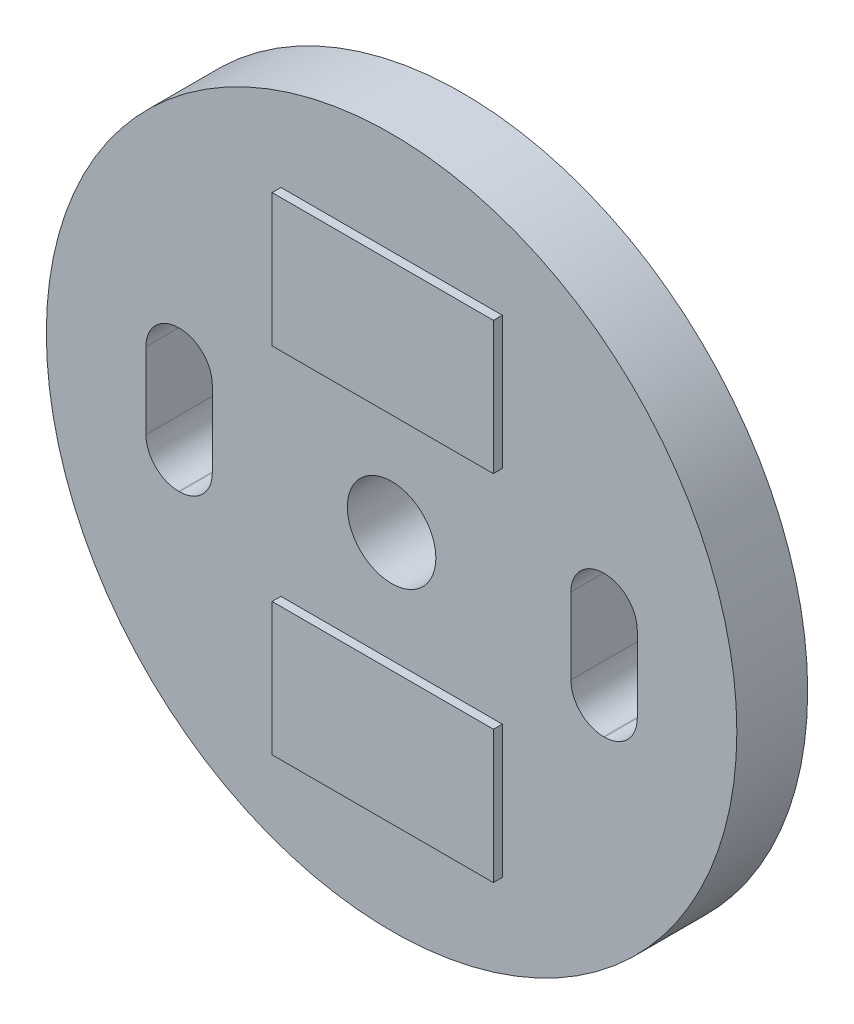
ISO-10303-21;
HEADER;
FILE_DESCRIPTION(('STEP AP214'),'2;1');
FILE_NAME('part.step','',(''),(''),'','','');
FILE_SCHEMA(('AUTOMOTIVE_DESIGN { 1 0 10303 214 1 1 1 1 }'));
ENDSEC;
DATA;
#1=APPLICATION_CONTEXT('core data for automotive mechanical design processes');
#2=APPLICATION_PROTOCOL_DEFINITION('international standard','automotive_design',2000,#1);
#3=PRODUCT_CONTEXT('',#1,'mechanical');
#4=PRODUCT('Part','Part','',(#3));
#5=PRODUCT_RELATED_PRODUCT_CATEGORY('part','',(#4));
#6=PRODUCT_DEFINITION_FORMATION('','',#4);
#7=PRODUCT_DEFINITION_CONTEXT('part definition',#1,'design');
#8=PRODUCT_DEFINITION('design','',#6,#7);
#9=PRODUCT_DEFINITION_SHAPE('','',#8);
#10=(LENGTH_UNIT() NAMED_UNIT(*) SI_UNIT(.MILLI.,.METRE.));
#11=(NAMED_UNIT(*) PLANE_ANGLE_UNIT() SI_UNIT($,.RADIAN.));
#12=(NAMED_UNIT(*) SI_UNIT($,.STERADIAN.) SOLID_ANGLE_UNIT());
#13=UNCERTAINTY_MEASURE_WITH_UNIT(LENGTH_MEASURE(1.E-05),#10,'distance_accuracy_value','');
#14=(GEOMETRIC_REPRESENTATION_CONTEXT(3) GLOBAL_UNCERTAINTY_ASSIGNED_CONTEXT((#13)) GLOBAL_UNIT_ASSIGNED_CONTEXT((#10,
#11,#12)) REPRESENTATION_CONTEXT('',''));
#15=CARTESIAN_POINT('',(0.,0.,0.));
#16=DIRECTION('',(0.,0.,1.));
#17=DIRECTION('',(1.,0.,0.));
#18=AXIS2_PLACEMENT_3D('',#15,#16,#17);
#19=CARTESIAN_POINT('',(0.,0.,0.8));
#20=DIRECTION('',(0.,0.,1.));
#21=DIRECTION('',(1.,0.,0.));
#22=AXIS2_PLACEMENT_3D('',#19,#20,#21);
#23=PLANE('',#22);
#24=CARTESIAN_POINT('',(0.,0.,0.8));
#25=DIRECTION('',(0.,0.,1.));
#26=DIRECTION('',(1.,0.,0.));
#27=AXIS2_PLACEMENT_3D('',#24,#25,#26);
#28=CIRCLE('',#27,3.9);
#29=CARTESIAN_POINT('',(3.9,0.,0.8));
#30=VERTEX_POINT('',#29);
#31=EDGE_CURVE('E11',#30,#30,#28,.T.);
#32=ORIENTED_EDGE('',*,*,#31,.T.);
#33=EDGE_LOOP('',(#32));
#34=FACE_BOUND('',#33,.T.);
#35=CARTESIAN_POINT('',(0.,0.,0.8));
#36=DIRECTION('',(0.,0.,1.));
#37=DIRECTION('',(1.,0.,0.));
#38=AXIS2_PLACEMENT_3D('',#35,#36,#37);
#39=CIRCLE('',#38,0.5);
#40=CARTESIAN_POINT('',(0.5,0.,0.8));
#41=VERTEX_POINT('',#40);
#42=EDGE_CURVE('E370',#41,#41,#39,.T.);
#43=ORIENTED_EDGE('',*,*,#42,.F.);
#44=EDGE_LOOP('',(#43));
#45=FACE_BOUND('',#44,.T.);
#46=DIRECTION('',(0.,1.,0.));
#47=VECTOR('',#46,1.);
#48=CARTESIAN_POINT('',(2.775,0.429999999999997,0.8));
#49=LINE('',#48,#47);
#50=CARTESIAN_POINT('',(2.775,-0.429999999999997,0.8));
#51=VERTEX_POINT('',#50);
#52=CARTESIAN_POINT('',(2.775,0.429999999999997,0.8));
#53=VERTEX_POINT('',#52);
#54=EDGE_CURVE('E313',#51,#53,#49,.T.);
#55=ORIENTED_EDGE('',*,*,#54,.F.);
#56=CARTESIAN_POINT('',(2.405,-0.43,0.8));
#57=DIRECTION('',(0.,0.,1.));
#58=DIRECTION('',(1.,0.,0.));
#59=AXIS2_PLACEMENT_3D('',#56,#57,#58);
#60=CIRCLE('',#59,0.37);
#61=CARTESIAN_POINT('',(2.405,-0.8,0.8));
#62=VERTEX_POINT('',#61);
#63=EDGE_CURVE('E311',#62,#51,#60,.T.);
#64=ORIENTED_EDGE('',*,*,#63,.F.);
#65=DIRECTION('',(1.,0.,0.));
#66=VECTOR('',#65,1.);
#67=CARTESIAN_POINT('',(2.395,-0.8,0.8));
#68=LINE('',#67,#66);
#69=CARTESIAN_POINT('',(2.395,-0.8,0.8));
#70=VERTEX_POINT('',#69);
#71=EDGE_CURVE('E327',#70,#62,#68,.T.);
#72=ORIENTED_EDGE('',*,*,#71,.F.);
#73=CARTESIAN_POINT('',(2.395,-0.43,0.8));
#74=DIRECTION('',(0.,0.,1.));
#75=DIRECTION('',(1.,0.,0.));
#76=AXIS2_PLACEMENT_3D('',#73,#74,#75);
#77=CIRCLE('',#76,0.37);
#78=CARTESIAN_POINT('',(2.025,-0.429999999999997,0.8));
#79=VERTEX_POINT('',#78);
#80=EDGE_CURVE('E324',#79,#70,#77,.T.);
#81=ORIENTED_EDGE('',*,*,#80,.F.);
#82=DIRECTION('',(0.,-1.,0.));
#83=VECTOR('',#82,1.);
#84=CARTESIAN_POINT('',(2.025,0.429999999999997,0.8));
#85=LINE('',#84,#83);
#86=CARTESIAN_POINT('',(2.025,0.429999999999997,0.8));
#87=VERTEX_POINT('',#86);
#88=EDGE_CURVE('E322',#87,#79,#85,.T.);
#89=ORIENTED_EDGE('',*,*,#88,.F.);
#90=CARTESIAN_POINT('',(2.395,0.43,0.8));
#91=DIRECTION('',(0.,0.,1.));
#92=DIRECTION('',(1.,0.,0.));
#93=AXIS2_PLACEMENT_3D('',#90,#91,#92);
#94=CIRCLE('',#93,0.37);
#95=CARTESIAN_POINT('',(2.395,0.8,0.8));
#96=VERTEX_POINT('',#95);
#97=EDGE_CURVE('E320',#96,#87,#94,.T.);
#98=ORIENTED_EDGE('',*,*,#97,.F.);
#99=DIRECTION('',(-1.,0.,0.));
#100=VECTOR('',#99,1.);
#101=CARTESIAN_POINT('',(2.395,0.8,0.8));
#102=LINE('',#101,#100);
#103=CARTESIAN_POINT('',(2.405,0.8,0.8));
#104=VERTEX_POINT('',#103);
#105=EDGE_CURVE('E318',#104,#96,#102,.T.);
#106=ORIENTED_EDGE('',*,*,#105,.F.);
#107=CARTESIAN_POINT('',(2.405,0.43,0.8));
#108=DIRECTION('',(0.,0.,1.));
#109=DIRECTION('',(-1.,0.,0.));
#110=AXIS2_PLACEMENT_3D('',#107,#108,#109);
#111=CIRCLE('',#110,0.37);
#112=EDGE_CURVE('E316',#53,#104,#111,.T.);
#113=ORIENTED_EDGE('',*,*,#112,.F.);
#114=EDGE_LOOP('',(#55,#64,#72,#81,#89,#98,#106,#113));
#115=FACE_BOUND('',#114,.T.);
#116=DIRECTION('',(0.,-1.,0.));
#117=VECTOR('',#116,1.);
#118=CARTESIAN_POINT('',(-2.775,0.429999999999998,0.8));
#119=LINE('',#118,#117);
#120=CARTESIAN_POINT('',(-2.775,0.429999999999998,0.8));
#121=VERTEX_POINT('',#120);
#122=CARTESIAN_POINT('',(-2.775,-0.429999999999997,0.8));
#123=VERTEX_POINT('',#122);
#124=EDGE_CURVE('E254',#121,#123,#119,.T.);
#125=ORIENTED_EDGE('',*,*,#124,.F.);
#126=CARTESIAN_POINT('',(-2.405,0.43,0.8));
#127=DIRECTION('',(0.,0.,1.));
#128=DIRECTION('',(1.,0.,0.));
#129=AXIS2_PLACEMENT_3D('',#126,#127,#128);
#130=CIRCLE('',#129,0.37);
#131=CARTESIAN_POINT('',(-2.405,0.8,0.8));
#132=VERTEX_POINT('',#131);
#133=EDGE_CURVE('E252',#132,#121,#130,.T.);
#134=ORIENTED_EDGE('',*,*,#133,.F.);
#135=DIRECTION('',(-1.,0.,0.));
#136=VECTOR('',#135,1.);
#137=CARTESIAN_POINT('',(-2.405,0.8,0.8));
#138=LINE('',#137,#136);
#139=CARTESIAN_POINT('',(-2.395,0.8,0.8));
#140=VERTEX_POINT('',#139);
#141=EDGE_CURVE('E268',#140,#132,#138,.T.);
#142=ORIENTED_EDGE('',*,*,#141,.F.);
#143=CARTESIAN_POINT('',(-2.395,0.43,0.8));
#144=DIRECTION('',(0.,0.,1.));
#145=DIRECTION('',(-1.,0.,0.));
#146=AXIS2_PLACEMENT_3D('',#143,#144,#145);
#147=CIRCLE('',#146,0.37);
#148=CARTESIAN_POINT('',(-2.025,0.429999999999998,0.8));
#149=VERTEX_POINT('',#148);
#150=EDGE_CURVE('E265',#149,#140,#147,.T.);
#151=ORIENTED_EDGE('',*,*,#150,.F.);
#152=DIRECTION('',(0.,1.,0.));
#153=VECTOR('',#152,1.);
#154=CARTESIAN_POINT('',(-2.025,0.429999999999998,0.8));
#155=LINE('',#154,#153);
#156=CARTESIAN_POINT('',(-2.025,-0.429999999999998,0.8));
#157=VERTEX_POINT('',#156);
#158=EDGE_CURVE('E263',#157,#149,#155,.T.);
#159=ORIENTED_EDGE('',*,*,#158,.F.);
#160=CARTESIAN_POINT('',(-2.395,-0.43,0.8));
#161=DIRECTION('',(0.,0.,1.));
#162=DIRECTION('',(1.,0.,0.));
#163=AXIS2_PLACEMENT_3D('',#160,#161,#162);
#164=CIRCLE('',#163,0.37);
#165=CARTESIAN_POINT('',(-2.395,-0.8,0.8));
#166=VERTEX_POINT('',#165);
#167=EDGE_CURVE('E261',#166,#157,#164,.T.);
#168=ORIENTED_EDGE('',*,*,#167,.F.);
#169=DIRECTION('',(1.,0.,0.));
#170=VECTOR('',#169,1.);
#171=CARTESIAN_POINT('',(-2.405,-0.8,0.8));
#172=LINE('',#171,#170);
#173=CARTESIAN_POINT('',(-2.405,-0.8,0.8));
#174=VERTEX_POINT('',#173);
#175=EDGE_CURVE('E259',#174,#166,#172,.T.);
#176=ORIENTED_EDGE('',*,*,#175,.F.);
#177=CARTESIAN_POINT('',(-2.405,-0.43,0.8));
#178=DIRECTION('',(0.,0.,1.));
#179=DIRECTION('',(1.,0.,0.));
#180=AXIS2_PLACEMENT_3D('',#177,#178,#179);
#181=CIRCLE('',#180,0.37);
#182=EDGE_CURVE('E257',#123,#174,#181,.T.);
#183=ORIENTED_EDGE('',*,*,#182,.F.);
#184=EDGE_LOOP('',(#125,#134,#142,#151,#159,#168,#176,#183));
#185=FACE_BOUND('',#184,.T.);
#186=DIRECTION('',(1.,0.,0.));
#187=VECTOR('',#186,1.);
#188=CARTESIAN_POINT('',(-1.25,1.25,0.8));
#189=LINE('',#188,#187);
#190=CARTESIAN_POINT('',(-1.25,1.25,0.8));
#191=VERTEX_POINT('',#190);
#192=CARTESIAN_POINT('',(1.25,1.25,0.8));
#193=VERTEX_POINT('',#192);
#194=EDGE_CURVE('E223',#191,#193,#189,.T.);
#195=ORIENTED_EDGE('',*,*,#194,.F.);
#196=DIRECTION('',(0.,-1.,0.));
#197=VECTOR('',#196,1.);
#198=CARTESIAN_POINT('',(-1.25,2.75,0.8));
#199=LINE('',#198,#197);
#200=CARTESIAN_POINT('',(-1.25,2.75,0.8));
#201=VERTEX_POINT('',#200);
#202=EDGE_CURVE('E220',#201,#191,#199,.T.);
#203=ORIENTED_EDGE('',*,*,#202,.F.);
#204=DIRECTION('',(-1.,0.,0.));
#205=VECTOR('',#204,1.);
#206=CARTESIAN_POINT('',(-1.25,2.75,0.8));
#207=LINE('',#206,#205);
#208=CARTESIAN_POINT('',(1.25,2.75,0.8));
#209=VERTEX_POINT('',#208);
#210=EDGE_CURVE('E232',#209,#201,#207,.T.);
#211=ORIENTED_EDGE('',*,*,#210,.F.);
#212=DIRECTION('',(0.,1.,0.));
#213=VECTOR('',#212,1.);
#214=CARTESIAN_POINT('',(1.25,2.75,0.8));
#215=LINE('',#214,#213);
#216=EDGE_CURVE('E240',#193,#209,#215,.T.);
#217=ORIENTED_EDGE('',*,*,#216,.F.);
#218=EDGE_LOOP('',(#195,#203,#211,#217));
#219=FACE_BOUND('',#218,.T.);
#220=DIRECTION('',(1.,0.,0.));
#221=VECTOR('',#220,1.);
#222=CARTESIAN_POINT('',(-1.25,-2.75,0.8));
#223=LINE('',#222,#221);
#224=CARTESIAN_POINT('',(-1.25,-2.75,0.8));
#225=VERTEX_POINT('',#224);
#226=CARTESIAN_POINT('',(1.25,-2.75,0.8));
#227=VERTEX_POINT('',#226);
#228=EDGE_CURVE('E418',#225,#227,#223,.T.);
#229=ORIENTED_EDGE('',*,*,#228,.F.);
#230=DIRECTION('',(0.,-1.,0.));
#231=VECTOR('',#230,1.);
#232=CARTESIAN_POINT('',(-1.25,-1.25,0.8));
#233=LINE('',#232,#231);
#234=CARTESIAN_POINT('',(-1.25,-1.25,0.8));
#235=VERTEX_POINT('',#234);
#236=EDGE_CURVE('E218',#235,#225,#233,.T.);
#237=ORIENTED_EDGE('',*,*,#236,.F.);
#238=DIRECTION('',(-1.,0.,0.));
#239=VECTOR('',#238,1.);
#240=CARTESIAN_POINT('',(-1.25,-1.25,0.8));
#241=LINE('',#240,#239);
#242=CARTESIAN_POINT('',(1.25,-1.25,0.8));
#243=VERTEX_POINT('',#242);
#244=EDGE_CURVE('E214',#243,#235,#241,.T.);
#245=ORIENTED_EDGE('',*,*,#244,.F.);
#246=DIRECTION('',(0.,1.,0.));
#247=VECTOR('',#246,1.);
#248=CARTESIAN_POINT('',(1.25,-1.25,0.8));
#249=LINE('',#248,#247);
#250=EDGE_CURVE('E420',#227,#243,#249,.T.);
#251=ORIENTED_EDGE('',*,*,#250,.F.);
#252=EDGE_LOOP('',(#229,#237,#245,#251));
#253=FACE_BOUND('',#252,.T.);
#254=ADVANCED_FACE('F33',(#34,#45,#115,#185,#219,#253),#23,.T.);
#255=CARTESIAN_POINT('',(0.,0.,0.));
#256=DIRECTION('',(0.,0.,1.));
#257=DIRECTION('',(1.,0.,0.));
#258=AXIS2_PLACEMENT_3D('',#255,#256,#257);
#259=PLANE('',#258);
#260=CARTESIAN_POINT('',(2.405,-0.43,0.));
#261=DIRECTION('',(0.,0.,1.));
#262=DIRECTION('',(1.,0.,0.));
#263=AXIS2_PLACEMENT_3D('',#260,#261,#262);
#264=CIRCLE('',#263,0.37);
#265=CARTESIAN_POINT('',(2.405,-0.8,0.));
#266=VERTEX_POINT('',#265);
#267=CARTESIAN_POINT('',(2.775,-0.429999999999997,0.));
#268=VERTEX_POINT('',#267);
#269=EDGE_CURVE('E310',#266,#268,#264,.T.);
#270=ORIENTED_EDGE('',*,*,#269,.T.);
#271=DIRECTION('',(0.,1.,0.));
#272=VECTOR('',#271,1.);
#273=CARTESIAN_POINT('',(2.775,0.429999999999997,0.));
#274=LINE('',#273,#272);
#275=CARTESIAN_POINT('',(2.775,0.429999999999997,0.));
#276=VERTEX_POINT('',#275);
#277=EDGE_CURVE('E332',#268,#276,#274,.T.);
#278=ORIENTED_EDGE('',*,*,#277,.T.);
#279=CARTESIAN_POINT('',(2.405,0.43,0.));
#280=DIRECTION('',(0.,0.,1.));
#281=DIRECTION('',(-1.,0.,0.));
#282=AXIS2_PLACEMENT_3D('',#279,#280,#281);
#283=CIRCLE('',#282,0.37);
#284=CARTESIAN_POINT('',(2.405,0.8,0.));
#285=VERTEX_POINT('',#284);
#286=EDGE_CURVE('E335',#276,#285,#283,.T.);
#287=ORIENTED_EDGE('',*,*,#286,.T.);
#288=DIRECTION('',(-1.,0.,0.));
#289=VECTOR('',#288,1.);
#290=CARTESIAN_POINT('',(2.395,0.8,0.));
#291=LINE('',#290,#289);
#292=CARTESIAN_POINT('',(2.395,0.8,0.));
#293=VERTEX_POINT('',#292);
#294=EDGE_CURVE('E338',#285,#293,#291,.T.);
#295=ORIENTED_EDGE('',*,*,#294,.T.);
#296=CARTESIAN_POINT('',(2.395,0.43,0.));
#297=DIRECTION('',(0.,0.,1.));
#298=DIRECTION('',(1.,0.,0.));
#299=AXIS2_PLACEMENT_3D('',#296,#297,#298);
#300=CIRCLE('',#299,0.37);
#301=CARTESIAN_POINT('',(2.025,0.429999999999997,0.));
#302=VERTEX_POINT('',#301);
#303=EDGE_CURVE('E341',#293,#302,#300,.T.);
#304=ORIENTED_EDGE('',*,*,#303,.T.);
#305=DIRECTION('',(0.,-1.,0.));
#306=VECTOR('',#305,1.);
#307=CARTESIAN_POINT('',(2.025,0.429999999999997,0.));
#308=LINE('',#307,#306);
#309=CARTESIAN_POINT('',(2.025,-0.429999999999997,0.));
#310=VERTEX_POINT('',#309);
#311=EDGE_CURVE('E344',#302,#310,#308,.T.);
#312=ORIENTED_EDGE('',*,*,#311,.T.);
#313=CARTESIAN_POINT('',(2.395,-0.43,0.));
#314=DIRECTION('',(0.,0.,1.));
#315=DIRECTION('',(1.,0.,0.));
#316=AXIS2_PLACEMENT_3D('',#313,#314,#315);
#317=CIRCLE('',#316,0.37);
#318=CARTESIAN_POINT('',(2.395,-0.8,0.));
#319=VERTEX_POINT('',#318);
#320=EDGE_CURVE('E347',#310,#319,#317,.T.);
#321=ORIENTED_EDGE('',*,*,#320,.T.);
#322=DIRECTION('',(1.,0.,0.));
#323=VECTOR('',#322,1.);
#324=CARTESIAN_POINT('',(2.395,-0.8,0.));
#325=LINE('',#324,#323);
#326=EDGE_CURVE('E314',#319,#266,#325,.T.);
#327=ORIENTED_EDGE('',*,*,#326,.T.);
#328=EDGE_LOOP('',(#270,#278,#287,#295,#304,#312,#321,#327));
#329=FACE_BOUND('',#328,.T.);
#330=CARTESIAN_POINT('',(0.,0.,0.));
#331=DIRECTION('',(0.,0.,1.));
#332=DIRECTION('',(1.,0.,0.));
#333=AXIS2_PLACEMENT_3D('',#330,#331,#332);
#334=CIRCLE('',#333,3.9);
#335=CARTESIAN_POINT('',(3.9,0.,0.));
#336=VERTEX_POINT('',#335);
#337=EDGE_CURVE('E37',#336,#336,#334,.T.);
#338=ORIENTED_EDGE('',*,*,#337,.F.);
#339=EDGE_LOOP('',(#338));
#340=FACE_BOUND('',#339,.T.);
#341=CARTESIAN_POINT('',(0.,0.,0.));
#342=DIRECTION('',(0.,0.,1.));
#343=DIRECTION('',(1.,0.,0.));
#344=AXIS2_PLACEMENT_3D('',#341,#342,#343);
#345=CIRCLE('',#344,0.5);
#346=CARTESIAN_POINT('',(0.5,0.,0.));
#347=VERTEX_POINT('',#346);
#348=EDGE_CURVE('E369',#347,#347,#345,.T.);
#349=ORIENTED_EDGE('',*,*,#348,.T.);
#350=EDGE_LOOP('',(#349));
#351=FACE_BOUND('',#350,.T.);
#352=CARTESIAN_POINT('',(-2.405,0.43,0.));
#353=DIRECTION('',(0.,0.,1.));
#354=DIRECTION('',(1.,0.,0.));
#355=AXIS2_PLACEMENT_3D('',#352,#353,#354);
#356=CIRCLE('',#355,0.37);
#357=CARTESIAN_POINT('',(-2.405,0.8,0.));
#358=VERTEX_POINT('',#357);
#359=CARTESIAN_POINT('',(-2.775,0.429999999999998,0.));
#360=VERTEX_POINT('',#359);
#361=EDGE_CURVE('E251',#358,#360,#356,.T.);
#362=ORIENTED_EDGE('',*,*,#361,.T.);
#363=DIRECTION('',(0.,-1.,0.));
#364=VECTOR('',#363,1.);
#365=CARTESIAN_POINT('',(-2.775,0.429999999999998,0.));
#366=LINE('',#365,#364);
#367=CARTESIAN_POINT('',(-2.775,-0.429999999999997,0.));
#368=VERTEX_POINT('',#367);
#369=EDGE_CURVE('E273',#360,#368,#366,.T.);
#370=ORIENTED_EDGE('',*,*,#369,.T.);
#371=CARTESIAN_POINT('',(-2.405,-0.43,0.));
#372=DIRECTION('',(0.,0.,1.));
#373=DIRECTION('',(1.,0.,0.));
#374=AXIS2_PLACEMENT_3D('',#371,#372,#373);
#375=CIRCLE('',#374,0.37);
#376=CARTESIAN_POINT('',(-2.405,-0.8,0.));
#377=VERTEX_POINT('',#376);
#378=EDGE_CURVE('E276',#368,#377,#375,.T.);
#379=ORIENTED_EDGE('',*,*,#378,.T.);
#380=DIRECTION('',(1.,0.,0.));
#381=VECTOR('',#380,1.);
#382=CARTESIAN_POINT('',(-2.405,-0.8,0.));
#383=LINE('',#382,#381);
#384=CARTESIAN_POINT('',(-2.395,-0.8,0.));
#385=VERTEX_POINT('',#384);
#386=EDGE_CURVE('E279',#377,#385,#383,.T.);
#387=ORIENTED_EDGE('',*,*,#386,.T.);
#388=CARTESIAN_POINT('',(-2.395,-0.43,0.));
#389=DIRECTION('',(0.,0.,1.));
#390=DIRECTION('',(1.,0.,0.));
#391=AXIS2_PLACEMENT_3D('',#388,#389,#390);
#392=CIRCLE('',#391,0.37);
#393=CARTESIAN_POINT('',(-2.025,-0.429999999999998,0.));
#394=VERTEX_POINT('',#393);
#395=EDGE_CURVE('E282',#385,#394,#392,.T.);
#396=ORIENTED_EDGE('',*,*,#395,.T.);
#397=DIRECTION('',(0.,1.,0.));
#398=VECTOR('',#397,1.);
#399=CARTESIAN_POINT('',(-2.025,0.429999999999998,0.));
#400=LINE('',#399,#398);
#401=CARTESIAN_POINT('',(-2.025,0.429999999999998,0.));
#402=VERTEX_POINT('',#401);
#403=EDGE_CURVE('E285',#394,#402,#400,.T.);
#404=ORIENTED_EDGE('',*,*,#403,.T.);
#405=CARTESIAN_POINT('',(-2.395,0.43,0.));
#406=DIRECTION('',(0.,0.,1.));
#407=DIRECTION('',(-1.,0.,0.));
#408=AXIS2_PLACEMENT_3D('',#405,#406,#407);
#409=CIRCLE('',#408,0.37);
#410=CARTESIAN_POINT('',(-2.395,0.8,0.));
#411=VERTEX_POINT('',#410);
#412=EDGE_CURVE('E288',#402,#411,#409,.T.);
#413=ORIENTED_EDGE('',*,*,#412,.T.);
#414=DIRECTION('',(-1.,0.,0.));
#415=VECTOR('',#414,1.);
#416=CARTESIAN_POINT('',(-2.405,0.8,0.));
#417=LINE('',#416,#415);
#418=EDGE_CURVE('E255',#411,#358,#417,.T.);
#419=ORIENTED_EDGE('',*,*,#418,.T.);
#420=EDGE_LOOP('',(#362,#370,#379,#387,#396,#404,#413,#419));
#421=FACE_BOUND('',#420,.T.);
#422=ADVANCED_FACE('F376',(#329,#340,#351,#421),#259,.F.);
#423=CARTESIAN_POINT('',(0.,0.,0.8));
#424=DIRECTION('',(0.,0.,-1.));
#425=DIRECTION('',(-1.,0.,0.));
#426=AXIS2_PLACEMENT_3D('',#423,#424,#425);
#427=CYLINDRICAL_SURFACE('',#426,3.9);
#428=ORIENTED_EDGE('',*,*,#31,.F.);
#429=EDGE_LOOP('',(#428));
#430=FACE_BOUND('',#429,.T.);
#431=ORIENTED_EDGE('',*,*,#337,.T.);
#432=EDGE_LOOP('',(#431));
#433=FACE_BOUND('',#432,.T.);
#434=ADVANCED_FACE('F35',(#430,#433),#427,.T.);
#435=CARTESIAN_POINT('',(0.,0.,0.8));
#436=DIRECTION('',(0.,0.,-1.));
#437=DIRECTION('',(-1.,0.,0.));
#438=AXIS2_PLACEMENT_3D('',#435,#436,#437);
#439=CYLINDRICAL_SURFACE('',#438,0.5);
#440=ORIENTED_EDGE('',*,*,#42,.T.);
#441=EDGE_LOOP('',(#440));
#442=FACE_BOUND('',#441,.T.);
#443=ORIENTED_EDGE('',*,*,#348,.F.);
#444=EDGE_LOOP('',(#443));
#445=FACE_BOUND('',#444,.T.);
#446=ADVANCED_FACE('F379',(#442,#445),#439,.F.);
#447=CARTESIAN_POINT('',(2.405,-0.43,0.8));
#448=DIRECTION('',(0.,0.,-1.));
#449=DIRECTION('',(-1.,0.,0.));
#450=AXIS2_PLACEMENT_3D('',#447,#448,#449);
#451=CYLINDRICAL_SURFACE('',#450,0.37);
#452=ORIENTED_EDGE('',*,*,#269,.F.);
#453=DIRECTION('',(0.,0.,-1.));
#454=VECTOR('',#453,1.);
#455=CARTESIAN_POINT('',(2.405,-0.8,0.8));
#456=LINE('',#455,#454);
#457=EDGE_CURVE('E329',#62,#266,#456,.T.);
#458=ORIENTED_EDGE('',*,*,#457,.F.);
#459=ORIENTED_EDGE('',*,*,#63,.T.);
#460=DIRECTION('',(0.,0.,-1.));
#461=VECTOR('',#460,1.);
#462=CARTESIAN_POINT('',(2.775,-0.429999999999997,0.8));
#463=LINE('',#462,#461);
#464=EDGE_CURVE('E366',#51,#268,#463,.T.);
#465=ORIENTED_EDGE('',*,*,#464,.T.);
#466=EDGE_LOOP('',(#452,#458,#459,#465));
#467=FACE_BOUND('',#466,.T.);
#468=ADVANCED_FACE('F381',(#467),#451,.F.);
#469=CARTESIAN_POINT('',(2.775,0.429999999999997,0.8));
#470=DIRECTION('',(-1.,0.,0.));
#471=DIRECTION('',(0.,0.,1.));
#472=AXIS2_PLACEMENT_3D('',#469,#470,#471);
#473=PLANE('',#472);
#474=ORIENTED_EDGE('',*,*,#277,.F.);
#475=ORIENTED_EDGE('',*,*,#464,.F.);
#476=ORIENTED_EDGE('',*,*,#54,.T.);
#477=DIRECTION('',(0.,0.,-1.));
#478=VECTOR('',#477,1.);
#479=CARTESIAN_POINT('',(2.775,0.429999999999997,0.8));
#480=LINE('',#479,#478);
#481=EDGE_CURVE('E364',#53,#276,#480,.T.);
#482=ORIENTED_EDGE('',*,*,#481,.T.);
#483=EDGE_LOOP('',(#474,#475,#476,#482));
#484=FACE_BOUND('',#483,.T.);
#485=ADVANCED_FACE('F388',(#484),#473,.T.);
#486=CARTESIAN_POINT('',(2.405,0.43,0.8));
#487=DIRECTION('',(0.,0.,-1.));
#488=DIRECTION('',(-1.,0.,0.));
#489=AXIS2_PLACEMENT_3D('',#486,#487,#488);
#490=CYLINDRICAL_SURFACE('',#489,0.37);
#491=ORIENTED_EDGE('',*,*,#286,.F.);
#492=ORIENTED_EDGE('',*,*,#481,.F.);
#493=ORIENTED_EDGE('',*,*,#112,.T.);
#494=DIRECTION('',(0.,0.,-1.));
#495=VECTOR('',#494,1.);
#496=CARTESIAN_POINT('',(2.405,0.8,0.8));
#497=LINE('',#496,#495);
#498=EDGE_CURVE('E362',#104,#285,#497,.T.);
#499=ORIENTED_EDGE('',*,*,#498,.T.);
#500=EDGE_LOOP('',(#491,#492,#493,#499));
#501=FACE_BOUND('',#500,.T.);
#502=ADVANCED_FACE('F515',(#501),#490,.F.);
#503=CARTESIAN_POINT('',(2.395,0.8,0.8));
#504=DIRECTION('',(0.,-1.,0.));
#505=DIRECTION('',(0.,0.,-1.));
#506=AXIS2_PLACEMENT_3D('',#503,#504,#505);
#507=PLANE('',#506);
#508=ORIENTED_EDGE('',*,*,#294,.F.);
#509=ORIENTED_EDGE('',*,*,#498,.F.);
#510=ORIENTED_EDGE('',*,*,#105,.T.);
#511=DIRECTION('',(0.,0.,-1.));
#512=VECTOR('',#511,1.);
#513=CARTESIAN_POINT('',(2.395,0.8,0.8));
#514=LINE('',#513,#512);
#515=EDGE_CURVE('E360',#96,#293,#514,.T.);
#516=ORIENTED_EDGE('',*,*,#515,.T.);
#517=EDGE_LOOP('',(#508,#509,#510,#516));
#518=FACE_BOUND('',#517,.T.);
#519=ADVANCED_FACE('F511',(#518),#507,.T.);
#520=CARTESIAN_POINT('',(2.395,0.43,0.8));
#521=DIRECTION('',(0.,0.,-1.));
#522=DIRECTION('',(-1.,0.,0.));
#523=AXIS2_PLACEMENT_3D('',#520,#521,#522);
#524=CYLINDRICAL_SURFACE('',#523,0.37);
#525=ORIENTED_EDGE('',*,*,#303,.F.);
#526=ORIENTED_EDGE('',*,*,#515,.F.);
#527=ORIENTED_EDGE('',*,*,#97,.T.);
#528=DIRECTION('',(0.,0.,-1.));
#529=VECTOR('',#528,1.);
#530=CARTESIAN_POINT('',(2.025,0.429999999999997,0.8));
#531=LINE('',#530,#529);
#532=EDGE_CURVE('E358',#87,#302,#531,.T.);
#533=ORIENTED_EDGE('',*,*,#532,.T.);
#534=EDGE_LOOP('',(#525,#526,#527,#533));
#535=FACE_BOUND('',#534,.T.);
#536=ADVANCED_FACE('F507',(#535),#524,.F.);
#537=CARTESIAN_POINT('',(2.025,0.429999999999997,0.8));
#538=DIRECTION('',(1.,0.,0.));
#539=DIRECTION('',(0.,0.,-1.));
#540=AXIS2_PLACEMENT_3D('',#537,#538,#539);
#541=PLANE('',#540);
#542=ORIENTED_EDGE('',*,*,#311,.F.);
#543=ORIENTED_EDGE('',*,*,#532,.F.);
#544=ORIENTED_EDGE('',*,*,#88,.T.);
#545=DIRECTION('',(0.,0.,-1.));
#546=VECTOR('',#545,1.);
#547=CARTESIAN_POINT('',(2.025,-0.429999999999997,0.8));
#548=LINE('',#547,#546);
#549=EDGE_CURVE('E356',#79,#310,#548,.T.);
#550=ORIENTED_EDGE('',*,*,#549,.T.);
#551=EDGE_LOOP('',(#542,#543,#544,#550));
#552=FACE_BOUND('',#551,.T.);
#553=ADVANCED_FACE('F503',(#552),#541,.T.);
#554=CARTESIAN_POINT('',(2.395,-0.43,0.8));
#555=DIRECTION('',(0.,0.,-1.));
#556=DIRECTION('',(-1.,0.,0.));
#557=AXIS2_PLACEMENT_3D('',#554,#555,#556);
#558=CYLINDRICAL_SURFACE('',#557,0.37);
#559=ORIENTED_EDGE('',*,*,#320,.F.);
#560=ORIENTED_EDGE('',*,*,#549,.F.);
#561=ORIENTED_EDGE('',*,*,#80,.T.);
#562=DIRECTION('',(0.,0.,-1.));
#563=VECTOR('',#562,1.);
#564=CARTESIAN_POINT('',(2.395,-0.8,0.8));
#565=LINE('',#564,#563);
#566=EDGE_CURVE('E354',#70,#319,#565,.T.);
#567=ORIENTED_EDGE('',*,*,#566,.T.);
#568=EDGE_LOOP('',(#559,#560,#561,#567));
#569=FACE_BOUND('',#568,.T.);
#570=ADVANCED_FACE('F499',(#569),#558,.F.);
#571=CARTESIAN_POINT('',(2.395,-0.8,0.8));
#572=DIRECTION('',(0.,1.,0.));
#573=DIRECTION('',(0.,0.,1.));
#574=AXIS2_PLACEMENT_3D('',#571,#572,#573);
#575=PLANE('',#574);
#576=ORIENTED_EDGE('',*,*,#326,.F.);
#577=ORIENTED_EDGE('',*,*,#566,.F.);
#578=ORIENTED_EDGE('',*,*,#71,.T.);
#579=ORIENTED_EDGE('',*,*,#457,.T.);
#580=EDGE_LOOP('',(#576,#577,#578,#579));
#581=FACE_BOUND('',#580,.T.);
#582=ADVANCED_FACE('F495',(#581),#575,.T.);
#583=CARTESIAN_POINT('',(-2.405,0.43,0.8));
#584=DIRECTION('',(0.,0.,-1.));
#585=DIRECTION('',(-1.,0.,0.));
#586=AXIS2_PLACEMENT_3D('',#583,#584,#585);
#587=CYLINDRICAL_SURFACE('',#586,0.37);
#588=ORIENTED_EDGE('',*,*,#361,.F.);
#589=DIRECTION('',(0.,0.,-1.));
#590=VECTOR('',#589,1.);
#591=CARTESIAN_POINT('',(-2.405,0.8,0.8));
#592=LINE('',#591,#590);
#593=EDGE_CURVE('E270',#132,#358,#592,.T.);
#594=ORIENTED_EDGE('',*,*,#593,.F.);
#595=ORIENTED_EDGE('',*,*,#133,.T.);
#596=DIRECTION('',(0.,0.,-1.));
#597=VECTOR('',#596,1.);
#598=CARTESIAN_POINT('',(-2.775,0.429999999999998,0.8));
#599=LINE('',#598,#597);
#600=EDGE_CURVE('E307',#121,#360,#599,.T.);
#601=ORIENTED_EDGE('',*,*,#600,.T.);
#602=EDGE_LOOP('',(#588,#594,#595,#601));
#603=FACE_BOUND('',#602,.T.);
#604=ADVANCED_FACE('F491',(#603),#587,.F.);
#605=CARTESIAN_POINT('',(-2.775,0.429999999999998,0.8));
#606=DIRECTION('',(1.,0.,0.));
#607=DIRECTION('',(0.,0.,-1.));
#608=AXIS2_PLACEMENT_3D('',#605,#606,#607);
#609=PLANE('',#608);
#610=ORIENTED_EDGE('',*,*,#369,.F.);
#611=ORIENTED_EDGE('',*,*,#600,.F.);
#612=ORIENTED_EDGE('',*,*,#124,.T.);
#613=DIRECTION('',(0.,0.,-1.));
#614=VECTOR('',#613,1.);
#615=CARTESIAN_POINT('',(-2.775,-0.429999999999997,0.8));
#616=LINE('',#615,#614);
#617=EDGE_CURVE('E305',#123,#368,#616,.T.);
#618=ORIENTED_EDGE('',*,*,#617,.T.);
#619=EDGE_LOOP('',(#610,#611,#612,#618));
#620=FACE_BOUND('',#619,.T.);
#621=ADVANCED_FACE('F487',(#620),#609,.T.);
#622=CARTESIAN_POINT('',(-2.405,-0.43,0.8));
#623=DIRECTION('',(0.,0.,-1.));
#624=DIRECTION('',(-1.,0.,0.));
#625=AXIS2_PLACEMENT_3D('',#622,#623,#624);
#626=CYLINDRICAL_SURFACE('',#625,0.37);
#627=ORIENTED_EDGE('',*,*,#378,.F.);
#628=ORIENTED_EDGE('',*,*,#617,.F.);
#629=ORIENTED_EDGE('',*,*,#182,.T.);
#630=DIRECTION('',(0.,0.,-1.));
#631=VECTOR('',#630,1.);
#632=CARTESIAN_POINT('',(-2.405,-0.8,0.8));
#633=LINE('',#632,#631);
#634=EDGE_CURVE('E303',#174,#377,#633,.T.);
#635=ORIENTED_EDGE('',*,*,#634,.T.);
#636=EDGE_LOOP('',(#627,#628,#629,#635));
#637=FACE_BOUND('',#636,.T.);
#638=ADVANCED_FACE('F483',(#637),#626,.F.);
#639=CARTESIAN_POINT('',(-2.405,-0.8,0.8));
#640=DIRECTION('',(0.,1.,0.));
#641=DIRECTION('',(0.,0.,1.));
#642=AXIS2_PLACEMENT_3D('',#639,#640,#641);
#643=PLANE('',#642);
#644=ORIENTED_EDGE('',*,*,#386,.F.);
#645=ORIENTED_EDGE('',*,*,#634,.F.);
#646=ORIENTED_EDGE('',*,*,#175,.T.);
#647=DIRECTION('',(0.,0.,-1.));
#648=VECTOR('',#647,1.);
#649=CARTESIAN_POINT('',(-2.395,-0.8,0.8));
#650=LINE('',#649,#648);
#651=EDGE_CURVE('E301',#166,#385,#650,.T.);
#652=ORIENTED_EDGE('',*,*,#651,.T.);
#653=EDGE_LOOP('',(#644,#645,#646,#652));
#654=FACE_BOUND('',#653,.T.);
#655=ADVANCED_FACE('F479',(#654),#643,.T.);
#656=CARTESIAN_POINT('',(-2.395,-0.43,0.8));
#657=DIRECTION('',(0.,0.,-1.));
#658=DIRECTION('',(-1.,0.,0.));
#659=AXIS2_PLACEMENT_3D('',#656,#657,#658);
#660=CYLINDRICAL_SURFACE('',#659,0.37);
#661=ORIENTED_EDGE('',*,*,#395,.F.);
#662=ORIENTED_EDGE('',*,*,#651,.F.);
#663=ORIENTED_EDGE('',*,*,#167,.T.);
#664=DIRECTION('',(0.,0.,-1.));
#665=VECTOR('',#664,1.);
#666=CARTESIAN_POINT('',(-2.025,-0.429999999999998,0.8));
#667=LINE('',#666,#665);
#668=EDGE_CURVE('E299',#157,#394,#667,.T.);
#669=ORIENTED_EDGE('',*,*,#668,.T.);
#670=EDGE_LOOP('',(#661,#662,#663,#669));
#671=FACE_BOUND('',#670,.T.);
#672=ADVANCED_FACE('F475',(#671),#660,.F.);
#673=CARTESIAN_POINT('',(-2.025,0.429999999999998,0.8));
#674=DIRECTION('',(-1.,0.,0.));
#675=DIRECTION('',(0.,0.,1.));
#676=AXIS2_PLACEMENT_3D('',#673,#674,#675);
#677=PLANE('',#676);
#678=ORIENTED_EDGE('',*,*,#403,.F.);
#679=ORIENTED_EDGE('',*,*,#668,.F.);
#680=ORIENTED_EDGE('',*,*,#158,.T.);
#681=DIRECTION('',(0.,0.,-1.));
#682=VECTOR('',#681,1.);
#683=CARTESIAN_POINT('',(-2.025,0.429999999999998,0.8));
#684=LINE('',#683,#682);
#685=EDGE_CURVE('E297',#149,#402,#684,.T.);
#686=ORIENTED_EDGE('',*,*,#685,.T.);
#687=EDGE_LOOP('',(#678,#679,#680,#686));
#688=FACE_BOUND('',#687,.T.);
#689=ADVANCED_FACE('F471',(#688),#677,.T.);
#690=CARTESIAN_POINT('',(-2.395,0.43,0.8));
#691=DIRECTION('',(0.,0.,-1.));
#692=DIRECTION('',(-1.,0.,0.));
#693=AXIS2_PLACEMENT_3D('',#690,#691,#692);
#694=CYLINDRICAL_SURFACE('',#693,0.37);
#695=ORIENTED_EDGE('',*,*,#412,.F.);
#696=ORIENTED_EDGE('',*,*,#685,.F.);
#697=ORIENTED_EDGE('',*,*,#150,.T.);
#698=DIRECTION('',(0.,0.,-1.));
#699=VECTOR('',#698,1.);
#700=CARTESIAN_POINT('',(-2.395,0.8,0.8));
#701=LINE('',#700,#699);
#702=EDGE_CURVE('E295',#140,#411,#701,.T.);
#703=ORIENTED_EDGE('',*,*,#702,.T.);
#704=EDGE_LOOP('',(#695,#696,#697,#703));
#705=FACE_BOUND('',#704,.T.);
#706=ADVANCED_FACE('F467',(#705),#694,.F.);
#707=CARTESIAN_POINT('',(-2.405,0.8,0.8));
#708=DIRECTION('',(0.,-1.,0.));
#709=DIRECTION('',(0.,0.,-1.));
#710=AXIS2_PLACEMENT_3D('',#707,#708,#709);
#711=PLANE('',#710);
#712=ORIENTED_EDGE('',*,*,#418,.F.);
#713=ORIENTED_EDGE('',*,*,#702,.F.);
#714=ORIENTED_EDGE('',*,*,#141,.T.);
#715=ORIENTED_EDGE('',*,*,#593,.T.);
#716=EDGE_LOOP('',(#712,#713,#714,#715));
#717=FACE_BOUND('',#716,.T.);
#718=ADVANCED_FACE('F463',(#717),#711,.T.);
#719=CARTESIAN_POINT('',(-1.25,2.75,0.9));
#720=DIRECTION('',(1.,0.,0.));
#721=DIRECTION('',(0.,1.,0.));
#722=AXIS2_PLACEMENT_3D('',#719,#720,#721);
#723=PLANE('',#722);
#724=ORIENTED_EDGE('',*,*,#202,.T.);
#725=DIRECTION('',(0.,0.,-1.));
#726=VECTOR('',#725,1.);
#727=CARTESIAN_POINT('',(-1.25,1.25,0.9));
#728=LINE('',#727,#726);
#729=CARTESIAN_POINT('',(-1.25,1.25,0.9));
#730=VERTEX_POINT('',#729);
#731=EDGE_CURVE('E249',#730,#191,#728,.T.);
#732=ORIENTED_EDGE('',*,*,#731,.F.);
#733=DIRECTION('',(0.,-1.,0.));
#734=VECTOR('',#733,1.);
#735=CARTESIAN_POINT('',(-1.25,2.75,0.9));
#736=LINE('',#735,#734);
#737=CARTESIAN_POINT('',(-1.25,2.75,0.9));
#738=VERTEX_POINT('',#737);
#739=EDGE_CURVE('E228',#738,#730,#736,.T.);
#740=ORIENTED_EDGE('',*,*,#739,.F.);
#741=DIRECTION('',(0.,0.,-1.));
#742=VECTOR('',#741,1.);
#743=CARTESIAN_POINT('',(-1.25,2.75,0.9));
#744=LINE('',#743,#742);
#745=EDGE_CURVE('E237',#738,#201,#744,.T.);
#746=ORIENTED_EDGE('',*,*,#745,.T.);
#747=EDGE_LOOP('',(#724,#732,#740,#746));
#748=FACE_BOUND('',#747,.T.);
#749=ADVANCED_FACE('F459',(#748),#723,.F.);
#750=CARTESIAN_POINT('',(-1.25,1.25,0.9));
#751=DIRECTION('',(0.,1.,0.));
#752=DIRECTION('',(-1.,0.,0.));
#753=AXIS2_PLACEMENT_3D('',#750,#751,#752);
#754=PLANE('',#753);
#755=ORIENTED_EDGE('',*,*,#194,.T.);
#756=DIRECTION('',(0.,0.,-1.));
#757=VECTOR('',#756,1.);
#758=CARTESIAN_POINT('',(1.25,1.25,0.9));
#759=LINE('',#758,#757);
#760=CARTESIAN_POINT('',(1.25,1.25,0.9));
#761=VERTEX_POINT('',#760);
#762=EDGE_CURVE('E246',#761,#193,#759,.T.);
#763=ORIENTED_EDGE('',*,*,#762,.F.);
#764=DIRECTION('',(1.,0.,0.));
#765=VECTOR('',#764,1.);
#766=CARTESIAN_POINT('',(-1.25,1.25,0.9));
#767=LINE('',#766,#765);
#768=EDGE_CURVE('E231',#730,#761,#767,.T.);
#769=ORIENTED_EDGE('',*,*,#768,.F.);
#770=ORIENTED_EDGE('',*,*,#731,.T.);
#771=EDGE_LOOP('',(#755,#763,#769,#770));
#772=FACE_BOUND('',#771,.T.);
#773=ADVANCED_FACE('F455',(#772),#754,.F.);
#774=CARTESIAN_POINT('',(1.25,2.75,0.9));
#775=DIRECTION('',(-1.,0.,0.));
#776=DIRECTION('',(0.,0.,1.));
#777=AXIS2_PLACEMENT_3D('',#774,#775,#776);
#778=PLANE('',#777);
#779=ORIENTED_EDGE('',*,*,#216,.T.);
#780=DIRECTION('',(0.,0.,-1.));
#781=VECTOR('',#780,1.);
#782=CARTESIAN_POINT('',(1.25,2.75,0.9));
#783=LINE('',#782,#781);
#784=CARTESIAN_POINT('',(1.25,2.75,0.9));
#785=VERTEX_POINT('',#784);
#786=EDGE_CURVE('E56',#785,#209,#783,.T.);
#787=ORIENTED_EDGE('',*,*,#786,.F.);
#788=DIRECTION('',(0.,1.,0.));
#789=VECTOR('',#788,1.);
#790=CARTESIAN_POINT('',(1.25,2.75,0.9));
#791=LINE('',#790,#789);
#792=EDGE_CURVE('E234',#761,#785,#791,.T.);
#793=ORIENTED_EDGE('',*,*,#792,.F.);
#794=ORIENTED_EDGE('',*,*,#762,.T.);
#795=EDGE_LOOP('',(#779,#787,#793,#794));
#796=FACE_BOUND('',#795,.T.);
#797=ADVANCED_FACE('F452',(#796),#778,.F.);
#798=CARTESIAN_POINT('',(-1.25,2.75,0.9));
#799=DIRECTION('',(0.,-1.,0.));
#800=DIRECTION('',(0.,0.,-1.));
#801=AXIS2_PLACEMENT_3D('',#798,#799,#800);
#802=PLANE('',#801);
#803=ORIENTED_EDGE('',*,*,#210,.T.);
#804=ORIENTED_EDGE('',*,*,#745,.F.);
#805=DIRECTION('',(-1.,0.,0.));
#806=VECTOR('',#805,1.);
#807=CARTESIAN_POINT('',(-1.25,2.75,0.9));
#808=LINE('',#807,#806);
#809=EDGE_CURVE('E236',#785,#738,#808,.T.);
#810=ORIENTED_EDGE('',*,*,#809,.F.);
#811=ORIENTED_EDGE('',*,*,#786,.T.);
#812=EDGE_LOOP('',(#803,#804,#810,#811));
#813=FACE_BOUND('',#812,.T.);
#814=ADVANCED_FACE('F448',(#813),#802,.F.);
#815=CARTESIAN_POINT('',(0.,0.,0.9));
#816=DIRECTION('',(0.,0.,1.));
#817=DIRECTION('',(1.,0.,0.));
#818=AXIS2_PLACEMENT_3D('',#815,#816,#817);
#819=PLANE('',#818);
#820=ORIENTED_EDGE('',*,*,#739,.T.);
#821=ORIENTED_EDGE('',*,*,#768,.T.);
#822=ORIENTED_EDGE('',*,*,#792,.T.);
#823=ORIENTED_EDGE('',*,*,#809,.T.);
#824=EDGE_LOOP('',(#820,#821,#822,#823));
#825=FACE_BOUND('',#824,.T.);
#826=ADVANCED_FACE('F445',(#825),#819,.T.);
#827=CARTESIAN_POINT('',(-1.25,-1.25,0.9));
#828=DIRECTION('',(1.,0.,0.));
#829=DIRECTION('',(0.,0.,-1.));
#830=AXIS2_PLACEMENT_3D('',#827,#828,#829);
#831=PLANE('',#830);
#832=ORIENTED_EDGE('',*,*,#236,.T.);
#833=DIRECTION('',(0.,0.,-1.));
#834=VECTOR('',#833,1.);
#835=CARTESIAN_POINT('',(-1.25,-2.75,0.9));
#836=LINE('',#835,#834);
#837=CARTESIAN_POINT('',(-1.25,-2.75,0.9));
#838=VERTEX_POINT('',#837);
#839=EDGE_CURVE('E199',#838,#225,#836,.T.);
#840=ORIENTED_EDGE('',*,*,#839,.F.);
#841=DIRECTION('',(0.,-1.,0.));
#842=VECTOR('',#841,1.);
#843=CARTESIAN_POINT('',(-1.25,-1.25,0.9));
#844=LINE('',#843,#842);
#845=CARTESIAN_POINT('',(-1.25,-1.25,0.9));
#846=VERTEX_POINT('',#845);
#847=EDGE_CURVE('E206',#846,#838,#844,.T.);
#848=ORIENTED_EDGE('',*,*,#847,.F.);
#849=DIRECTION('',(0.,0.,-1.));
#850=VECTOR('',#849,1.);
#851=CARTESIAN_POINT('',(-1.25,-1.25,0.9));
#852=LINE('',#851,#850);
#853=EDGE_CURVE('E427',#846,#235,#852,.T.);
#854=ORIENTED_EDGE('',*,*,#853,.T.);
#855=EDGE_LOOP('',(#832,#840,#848,#854));
#856=FACE_BOUND('',#855,.T.);
#857=ADVANCED_FACE('F216',(#856),#831,.F.);
#858=CARTESIAN_POINT('',(-1.25,-2.75,0.9));
#859=DIRECTION('',(0.,1.,0.));
#860=DIRECTION('',(0.,0.,1.));
#861=AXIS2_PLACEMENT_3D('',#858,#859,#860);
#862=PLANE('',#861);
#863=ORIENTED_EDGE('',*,*,#228,.T.);
#864=DIRECTION('',(0.,0.,-1.));
#865=VECTOR('',#864,1.);
#866=CARTESIAN_POINT('',(1.25,-2.75,0.9));
#867=LINE('',#866,#865);
#868=CARTESIAN_POINT('',(1.25,-2.75,0.9));
#869=VERTEX_POINT('',#868);
#870=EDGE_CURVE('E202',#869,#227,#867,.T.);
#871=ORIENTED_EDGE('',*,*,#870,.F.);
#872=DIRECTION('',(1.,0.,0.));
#873=VECTOR('',#872,1.);
#874=CARTESIAN_POINT('',(-1.25,-2.75,0.9));
#875=LINE('',#874,#873);
#876=EDGE_CURVE('E195',#838,#869,#875,.T.);
#877=ORIENTED_EDGE('',*,*,#876,.F.);
#878=ORIENTED_EDGE('',*,*,#839,.T.);
#879=EDGE_LOOP('',(#863,#871,#877,#878));
#880=FACE_BOUND('',#879,.T.);
#881=ADVANCED_FACE('F197',(#880),#862,.F.);
#882=CARTESIAN_POINT('',(1.25,-1.25,0.9));
#883=DIRECTION('',(-1.,0.,0.));
#884=DIRECTION('',(0.,0.,1.));
#885=AXIS2_PLACEMENT_3D('',#882,#883,#884);
#886=PLANE('',#885);
#887=ORIENTED_EDGE('',*,*,#250,.T.);
#888=DIRECTION('',(0.,0.,-1.));
#889=VECTOR('',#888,1.);
#890=CARTESIAN_POINT('',(1.25,-1.25,0.9));
#891=LINE('',#890,#889);
#892=CARTESIAN_POINT('',(1.25,-1.25,0.9));
#893=VERTEX_POINT('',#892);
#894=EDGE_CURVE('E48',#893,#243,#891,.T.);
#895=ORIENTED_EDGE('',*,*,#894,.F.);
#896=DIRECTION('',(0.,1.,0.));
#897=VECTOR('',#896,1.);
#898=CARTESIAN_POINT('',(1.25,-1.25,0.9));
#899=LINE('',#898,#897);
#900=EDGE_CURVE('E205',#869,#893,#899,.T.);
#901=ORIENTED_EDGE('',*,*,#900,.F.);
#902=ORIENTED_EDGE('',*,*,#870,.T.);
#903=EDGE_LOOP('',(#887,#895,#901,#902));
#904=FACE_BOUND('',#903,.T.);
#905=ADVANCED_FACE('F430',(#904),#886,.F.);
#906=CARTESIAN_POINT('',(-1.25,-1.25,0.9));
#907=DIRECTION('',(0.,-1.,0.));
#908=DIRECTION('',(0.,0.,-1.));
#909=AXIS2_PLACEMENT_3D('',#906,#907,#908);
#910=PLANE('',#909);
#911=ORIENTED_EDGE('',*,*,#244,.T.);
#912=ORIENTED_EDGE('',*,*,#853,.F.);
#913=DIRECTION('',(-1.,0.,0.));
#914=VECTOR('',#913,1.);
#915=CARTESIAN_POINT('',(-1.25,-1.25,0.9));
#916=LINE('',#915,#914);
#917=EDGE_CURVE('E210',#893,#846,#916,.T.);
#918=ORIENTED_EDGE('',*,*,#917,.F.);
#919=ORIENTED_EDGE('',*,*,#894,.T.);
#920=EDGE_LOOP('',(#911,#912,#918,#919));
#921=FACE_BOUND('',#920,.T.);
#922=ADVANCED_FACE('F431',(#921),#910,.F.);
#923=CARTESIAN_POINT('',(0.,0.,0.9));
#924=DIRECTION('',(0.,0.,1.));
#925=DIRECTION('',(1.,0.,0.));
#926=AXIS2_PLACEMENT_3D('',#923,#924,#925);
#927=PLANE('',#926);
#928=ORIENTED_EDGE('',*,*,#847,.T.);
#929=ORIENTED_EDGE('',*,*,#876,.T.);
#930=ORIENTED_EDGE('',*,*,#900,.T.);
#931=ORIENTED_EDGE('',*,*,#917,.T.);
#932=EDGE_LOOP('',(#928,#929,#930,#931));
#933=FACE_BOUND('',#932,.T.);
#934=ADVANCED_FACE('F209',(#933),#927,.T.);
#935=CLOSED_SHELL('',(#254,#422,#434,#446,#468,#485,#502,#519,#536,#553,#570,#582,#604,#621,
#638,#655,#672,#689,#706,#718,#749,#773,#797,#814,#826,#857,#881,#905,#922,#934));
#936=MANIFOLD_SOLID_BREP('B2',#935);
#937=ADVANCED_BREP_SHAPE_REPRESENTATION('',(#18,#936),#14);
#938=SHAPE_DEFINITION_REPRESENTATION(#9,#937);
ENDSEC;
END-ISO-10303-21;
